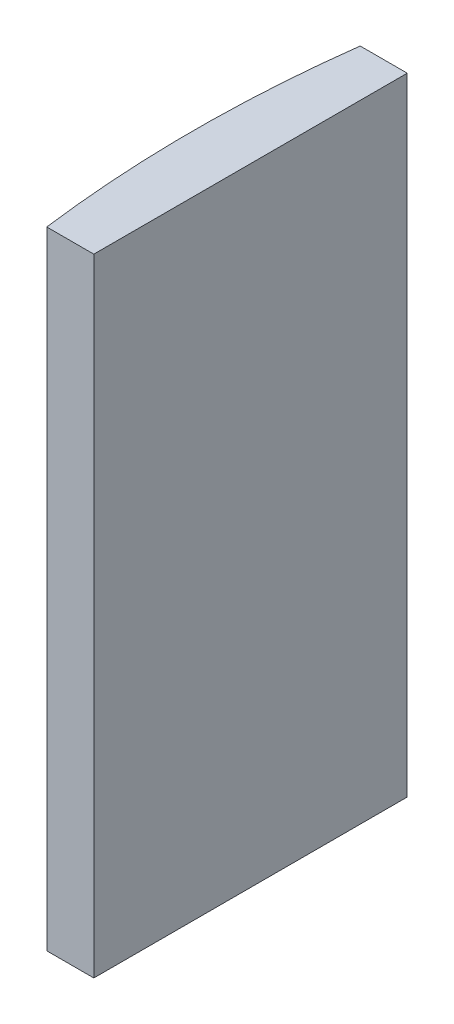
ISO-10303-21;
HEADER;
FILE_DESCRIPTION(('STEP AP214'),'2;1');
FILE_NAME('part.step','',(''),(''),'','','');
FILE_SCHEMA(('AUTOMOTIVE_DESIGN { 1 0 10303 214 1 1 1 1 }'));
ENDSEC;
DATA;
#1=APPLICATION_CONTEXT('core data for automotive mechanical design processes');
#2=APPLICATION_PROTOCOL_DEFINITION('international standard','automotive_design',2000,#1);
#3=PRODUCT_CONTEXT('',#1,'mechanical');
#4=PRODUCT('Part','Part','',(#3));
#5=PRODUCT_RELATED_PRODUCT_CATEGORY('part','',(#4));
#6=PRODUCT_DEFINITION_FORMATION('','',#4);
#7=PRODUCT_DEFINITION_CONTEXT('part definition',#1,'design');
#8=PRODUCT_DEFINITION('design','',#6,#7);
#9=PRODUCT_DEFINITION_SHAPE('','',#8);
#10=(LENGTH_UNIT() NAMED_UNIT(*) SI_UNIT(.MILLI.,.METRE.));
#11=(NAMED_UNIT(*) PLANE_ANGLE_UNIT() SI_UNIT($,.RADIAN.));
#12=(NAMED_UNIT(*) SI_UNIT($,.STERADIAN.) SOLID_ANGLE_UNIT());
#13=UNCERTAINTY_MEASURE_WITH_UNIT(LENGTH_MEASURE(1.E-05),#10,'distance_accuracy_value','');
#14=(GEOMETRIC_REPRESENTATION_CONTEXT(3) GLOBAL_UNCERTAINTY_ASSIGNED_CONTEXT((#13)) GLOBAL_UNIT_ASSIGNED_CONTEXT((#10,
#11,#12)) REPRESENTATION_CONTEXT('',''));
#15=CARTESIAN_POINT('',(0.,0.,0.));
#16=DIRECTION('',(0.,0.,1.));
#17=DIRECTION('',(1.,0.,0.));
#18=AXIS2_PLACEMENT_3D('',#15,#16,#17);
#19=CARTESIAN_POINT('',(4.35520433485127,40.,0.));
#20=DIRECTION('',(0.,-1.,0.));
#21=DIRECTION('',(0.,0.,-1.));
#22=AXIS2_PLACEMENT_3D('',#19,#20,#21);
#23=CYLINDRICAL_SURFACE('',#22,77.55);
#24=CARTESIAN_POINT('',(4.35520433485127,0.,0.));
#25=DIRECTION('',(0.,1.,0.));
#26=DIRECTION('',(0.,0.,1.));
#27=AXIS2_PLACEMENT_3D('',#24,#25,#26);
#28=CIRCLE('',#27,77.55);
#29=CARTESIAN_POINT('',(-72.547347638409,0.,-10.));
#30=VERTEX_POINT('',#29);
#31=CARTESIAN_POINT('',(-72.547347638409,0.,10.));
#32=VERTEX_POINT('',#31);
#33=EDGE_CURVE('E100',#30,#32,#28,.T.);
#34=ORIENTED_EDGE('',*,*,#33,.T.);
#35=DIRECTION('',(0.,-1.,0.));
#36=VECTOR('',#35,1.);
#37=CARTESIAN_POINT('',(-72.547347638409,40.,10.));
#38=LINE('',#37,#36);
#39=CARTESIAN_POINT('',(-72.547347638409,40.,10.));
#40=VERTEX_POINT('',#39);
#41=EDGE_CURVE('E11',#40,#32,#38,.T.);
#42=ORIENTED_EDGE('',*,*,#41,.F.);
#43=CARTESIAN_POINT('',(4.35520433485127,40.,0.));
#44=DIRECTION('',(0.,1.,0.));
#45=DIRECTION('',(0.,0.,1.));
#46=AXIS2_PLACEMENT_3D('',#43,#44,#45);
#47=CIRCLE('',#46,77.55);
#48=CARTESIAN_POINT('',(-72.547347638409,40.,-10.));
#49=VERTEX_POINT('',#48);
#50=EDGE_CURVE('E88',#49,#40,#47,.T.);
#51=ORIENTED_EDGE('',*,*,#50,.F.);
#52=DIRECTION('',(0.,-1.,0.));
#53=VECTOR('',#52,1.);
#54=CARTESIAN_POINT('',(-72.547347638409,40.,-10.));
#55=LINE('',#54,#53);
#56=EDGE_CURVE('E96',#49,#30,#55,.T.);
#57=ORIENTED_EDGE('',*,*,#56,.T.);
#58=EDGE_LOOP('',(#34,#42,#51,#57));
#59=FACE_BOUND('',#58,.T.);
#60=ADVANCED_FACE('F37',(#59),#23,.T.);
#61=CARTESIAN_POINT('',(-72.547347638409,40.,10.));
#62=DIRECTION('',(0.,0.,-1.));
#63=DIRECTION('',(-1.,0.,0.));
#64=AXIS2_PLACEMENT_3D('',#61,#62,#63);
#65=PLANE('',#64);
#66=DIRECTION('',(1.,0.,0.));
#67=VECTOR('',#66,1.);
#68=CARTESIAN_POINT('',(-72.547347638409,0.,10.));
#69=LINE('',#68,#67);
#70=CARTESIAN_POINT('',(-69.5447956651487,0.,10.));
#71=VERTEX_POINT('',#70);
#72=EDGE_CURVE('E92',#32,#71,#69,.T.);
#73=ORIENTED_EDGE('',*,*,#72,.T.);
#74=DIRECTION('',(0.,-1.,0.));
#75=VECTOR('',#74,1.);
#76=CARTESIAN_POINT('',(-69.5447956651487,40.,10.));
#77=LINE('',#76,#75);
#78=CARTESIAN_POINT('',(-69.5447956651487,40.,10.));
#79=VERTEX_POINT('',#78);
#80=EDGE_CURVE('E45',#79,#71,#77,.T.);
#81=ORIENTED_EDGE('',*,*,#80,.F.);
#82=DIRECTION('',(1.,0.,0.));
#83=VECTOR('',#82,1.);
#84=CARTESIAN_POINT('',(-72.547347638409,40.,10.));
#85=LINE('',#84,#83);
#86=EDGE_CURVE('E83',#40,#79,#85,.T.);
#87=ORIENTED_EDGE('',*,*,#86,.F.);
#88=ORIENTED_EDGE('',*,*,#41,.T.);
#89=EDGE_LOOP('',(#73,#81,#87,#88));
#90=FACE_BOUND('',#89,.T.);
#91=ADVANCED_FACE('F91',(#90),#65,.F.);
#92=CARTESIAN_POINT('',(-69.5447956651487,40.,-9.99999999999998));
#93=DIRECTION('',(-1.,0.,0.));
#94=DIRECTION('',(0.,0.,1.));
#95=AXIS2_PLACEMENT_3D('',#92,#93,#94);
#96=PLANE('',#95);
#97=DIRECTION('',(0.,0.,-1.));
#98=VECTOR('',#97,1.);
#99=CARTESIAN_POINT('',(-69.5447956651487,0.,-9.99999999999998));
#100=LINE('',#99,#98);
#101=CARTESIAN_POINT('',(-69.5447956651487,0.,-9.99999999999998));
#102=VERTEX_POINT('',#101);
#103=EDGE_CURVE('E70',#71,#102,#100,.T.);
#104=ORIENTED_EDGE('',*,*,#103,.T.);
#105=DIRECTION('',(0.,-1.,0.));
#106=VECTOR('',#105,1.);
#107=CARTESIAN_POINT('',(-69.5447956651487,40.,-9.99999999999998));
#108=LINE('',#107,#106);
#109=CARTESIAN_POINT('',(-69.5447956651487,40.,-9.99999999999998));
#110=VERTEX_POINT('',#109);
#111=EDGE_CURVE('E93',#110,#102,#108,.T.);
#112=ORIENTED_EDGE('',*,*,#111,.F.);
#113=DIRECTION('',(0.,0.,-1.));
#114=VECTOR('',#113,1.);
#115=CARTESIAN_POINT('',(-69.5447956651487,40.,-9.99999999999998));
#116=LINE('',#115,#114);
#117=EDGE_CURVE('E86',#79,#110,#116,.T.);
#118=ORIENTED_EDGE('',*,*,#117,.F.);
#119=ORIENTED_EDGE('',*,*,#80,.T.);
#120=EDGE_LOOP('',(#104,#112,#118,#119));
#121=FACE_BOUND('',#120,.T.);
#122=ADVANCED_FACE('F94',(#121),#96,.F.);
#123=CARTESIAN_POINT('',(-72.547347638409,40.,-10.));
#124=DIRECTION('',(0.,0.,1.));
#125=DIRECTION('',(1.,0.,0.));
#126=AXIS2_PLACEMENT_3D('',#123,#124,#125);
#127=PLANE('',#126);
#128=DIRECTION('',(-1.,0.,0.));
#129=VECTOR('',#128,1.);
#130=CARTESIAN_POINT('',(-72.547347638409,0.,-10.));
#131=LINE('',#130,#129);
#132=EDGE_CURVE('E76',#102,#30,#131,.T.);
#133=ORIENTED_EDGE('',*,*,#132,.T.);
#134=ORIENTED_EDGE('',*,*,#56,.F.);
#135=DIRECTION('',(-1.,0.,0.));
#136=VECTOR('',#135,1.);
#137=CARTESIAN_POINT('',(-72.547347638409,40.,-10.));
#138=LINE('',#137,#136);
#139=EDGE_CURVE('E53',#110,#49,#138,.T.);
#140=ORIENTED_EDGE('',*,*,#139,.F.);
#141=ORIENTED_EDGE('',*,*,#111,.T.);
#142=EDGE_LOOP('',(#133,#134,#140,#141));
#143=FACE_BOUND('',#142,.T.);
#144=ADVANCED_FACE('F107',(#143),#127,.F.);
#145=CARTESIAN_POINT('',(4.35520433485127,40.,0.));
#146=DIRECTION('',(0.,1.,0.));
#147=DIRECTION('',(0.,0.,1.));
#148=AXIS2_PLACEMENT_3D('',#145,#146,#147);
#149=PLANE('',#148);
#150=ORIENTED_EDGE('',*,*,#50,.T.);
#151=ORIENTED_EDGE('',*,*,#86,.T.);
#152=ORIENTED_EDGE('',*,*,#117,.T.);
#153=ORIENTED_EDGE('',*,*,#139,.T.);
#154=EDGE_LOOP('',(#150,#151,#152,#153));
#155=FACE_BOUND('',#154,.T.);
#156=ADVANCED_FACE('F84',(#155),#149,.T.);
#157=CARTESIAN_POINT('',(4.35520433485127,0.,0.));
#158=DIRECTION('',(0.,1.,0.));
#159=DIRECTION('',(0.,0.,1.));
#160=AXIS2_PLACEMENT_3D('',#157,#158,#159);
#161=PLANE('',#160);
#162=ORIENTED_EDGE('',*,*,#33,.F.);
#163=ORIENTED_EDGE('',*,*,#132,.F.);
#164=ORIENTED_EDGE('',*,*,#103,.F.);
#165=ORIENTED_EDGE('',*,*,#72,.F.);
#166=EDGE_LOOP('',(#162,#163,#164,#165));
#167=FACE_BOUND('',#166,.T.);
#168=ADVANCED_FACE('F110',(#167),#161,.F.);
#169=CLOSED_SHELL('',(#60,#91,#122,#144,#156,#168));
#170=MANIFOLD_SOLID_BREP('B2',#169);
#171=ADVANCED_BREP_SHAPE_REPRESENTATION('',(#18,#170),#14);
#172=SHAPE_DEFINITION_REPRESENTATION(#9,#171);
ENDSEC;
END-ISO-10303-21;
